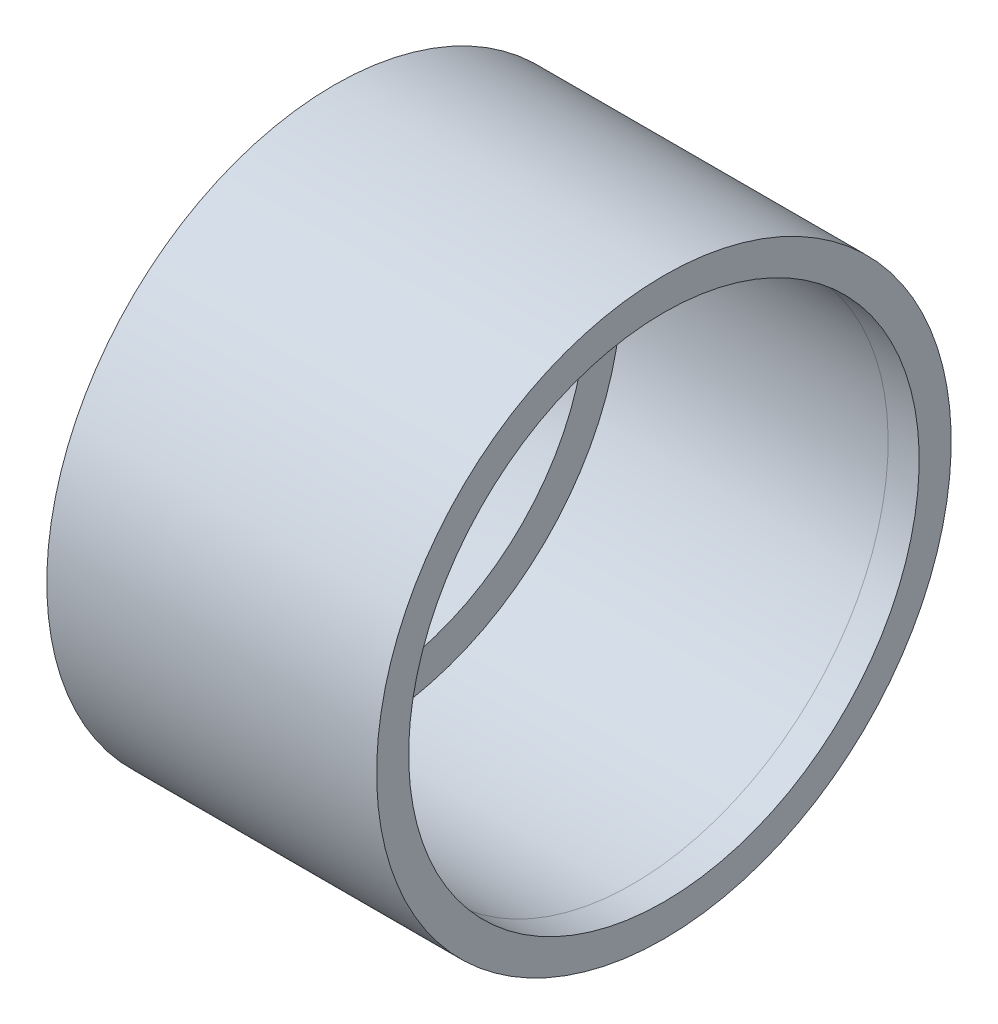
ISO-10303-21;
HEADER;
FILE_DESCRIPTION(('STEP AP214'),'2;1');
FILE_NAME('part.step','',(''),(''),'','','');
FILE_SCHEMA(('AUTOMOTIVE_DESIGN { 1 0 10303 214 1 1 1 1 }'));
ENDSEC;
DATA;
#1=APPLICATION_CONTEXT('core data for automotive mechanical design processes');
#2=APPLICATION_PROTOCOL_DEFINITION('international standard','automotive_design',2000,#1);
#3=PRODUCT_CONTEXT('',#1,'mechanical');
#4=PRODUCT('Part','Part','',(#3));
#5=PRODUCT_RELATED_PRODUCT_CATEGORY('part','',(#4));
#6=PRODUCT_DEFINITION_FORMATION('','',#4);
#7=PRODUCT_DEFINITION_CONTEXT('part definition',#1,'design');
#8=PRODUCT_DEFINITION('design','',#6,#7);
#9=PRODUCT_DEFINITION_SHAPE('','',#8);
#10=(LENGTH_UNIT() NAMED_UNIT(*) SI_UNIT(.MILLI.,.METRE.));
#11=(NAMED_UNIT(*) PLANE_ANGLE_UNIT() SI_UNIT($,.RADIAN.));
#12=(NAMED_UNIT(*) SI_UNIT($,.STERADIAN.) SOLID_ANGLE_UNIT());
#13=UNCERTAINTY_MEASURE_WITH_UNIT(LENGTH_MEASURE(1.E-05),#10,'distance_accuracy_value','');
#14=(GEOMETRIC_REPRESENTATION_CONTEXT(3) GLOBAL_UNCERTAINTY_ASSIGNED_CONTEXT((#13)) GLOBAL_UNIT_ASSIGNED_CONTEXT((#10,
#11,#12)) REPRESENTATION_CONTEXT('',''));
#15=CARTESIAN_POINT('',(0.,0.,0.));
#16=DIRECTION('',(0.,0.,1.));
#17=DIRECTION('',(1.,0.,0.));
#18=AXIS2_PLACEMENT_3D('',#15,#16,#17);
#19=CARTESIAN_POINT('',(-18.9164281281048,0.,0.));
#20=DIRECTION('',(1.,0.,0.));
#21=DIRECTION('',(0.,1.,0.));
#22=AXIS2_PLACEMENT_3D('',#19,#20,#21);
#23=PLANE('',#22);
#24=CARTESIAN_POINT('',(-18.9164281281048,0.,0.));
#25=DIRECTION('',(-1.,0.,0.));
#26=DIRECTION('',(0.,-1.,0.));
#27=AXIS2_PLACEMENT_3D('',#24,#25,#26);
#28=CIRCLE('',#27,13.4055538021859);
#29=CARTESIAN_POINT('',(-18.9164281281048,-13.4055538021859,0.));
#30=VERTEX_POINT('',#29);
#31=EDGE_CURVE('E53',#30,#30,#28,.T.);
#32=ORIENTED_EDGE('',*,*,#31,.F.);
#33=EDGE_LOOP('',(#32));
#34=FACE_BOUND('',#33,.T.);
#35=CARTESIAN_POINT('',(-18.9164281281048,0.,0.));
#36=DIRECTION('',(1.,0.,0.));
#37=DIRECTION('',(0.,1.,0.));
#38=AXIS2_PLACEMENT_3D('',#35,#36,#37);
#39=CIRCLE('',#38,18.2189897640092);
#40=CARTESIAN_POINT('',(-18.9164281281048,18.2189897640092,0.));
#41=VERTEX_POINT('',#40);
#42=EDGE_CURVE('E41',#41,#41,#39,.T.);
#43=ORIENTED_EDGE('',*,*,#42,.F.);
#44=EDGE_LOOP('',(#43));
#45=FACE_BOUND('',#44,.T.);
#46=ADVANCED_FACE('F31',(#34,#45),#23,.F.);
#47=CARTESIAN_POINT('',(2.,0.,0.));
#48=DIRECTION('',(-1.,0.,0.));
#49=DIRECTION('',(0.,-1.,0.));
#50=AXIS2_PLACEMENT_3D('',#47,#48,#49);
#51=PLANE('',#50);
#52=CARTESIAN_POINT('',(1.99999999999997,0.,0.));
#53=DIRECTION('',(-1.,0.,0.));
#54=DIRECTION('',(0.,-1.,0.));
#55=AXIS2_PLACEMENT_3D('',#52,#53,#54);
#56=CIRCLE('',#55,16.1882132471324);
#57=CARTESIAN_POINT('',(1.99999999999997,-16.1882132471324,0.));
#58=VERTEX_POINT('',#57);
#59=EDGE_CURVE('E56',#58,#58,#56,.T.);
#60=ORIENTED_EDGE('',*,*,#59,.T.);
#61=EDGE_LOOP('',(#60));
#62=FACE_BOUND('',#61,.T.);
#63=CARTESIAN_POINT('',(2.,0.,0.));
#64=DIRECTION('',(1.,0.,0.));
#65=DIRECTION('',(0.,1.,0.));
#66=AXIS2_PLACEMENT_3D('',#63,#64,#65);
#67=CIRCLE('',#66,18.2189897640092);
#68=CARTESIAN_POINT('',(2.,18.2189897640092,0.));
#69=VERTEX_POINT('',#68);
#70=EDGE_CURVE('E37',#69,#69,#67,.T.);
#71=ORIENTED_EDGE('',*,*,#70,.T.);
#72=EDGE_LOOP('',(#71));
#73=FACE_BOUND('',#72,.T.);
#74=ADVANCED_FACE('F60',(#62,#73),#51,.F.);
#75=CARTESIAN_POINT('',(-16.9164281281048,0.,0.));
#76=DIRECTION('',(1.,0.,0.));
#77=DIRECTION('',(0.,1.,0.));
#78=AXIS2_PLACEMENT_3D('',#75,#76,#77);
#79=CYLINDRICAL_SURFACE('',#78,18.2189897640092);
#80=ORIENTED_EDGE('',*,*,#70,.F.);
#81=EDGE_LOOP('',(#80));
#82=FACE_BOUND('',#81,.T.);
#83=ORIENTED_EDGE('',*,*,#42,.T.);
#84=EDGE_LOOP('',(#83));
#85=FACE_BOUND('',#84,.T.);
#86=ADVANCED_FACE('F66',(#82,#85),#79,.T.);
#87=CARTESIAN_POINT('',(0.,0.,0.));
#88=DIRECTION('',(-1.,0.,0.));
#89=DIRECTION('',(0.,-1.,0.));
#90=AXIS2_PLACEMENT_3D('',#87,#88,#89);
#91=DEGENERATE_TOROIDAL_SURFACE('',#90,48.7810102359908,65.,.F.);
#92=ORIENTED_EDGE('',*,*,#59,.F.);
#93=EDGE_LOOP('',(#92));
#94=FACE_BOUND('',#93,.T.);
#95=CARTESIAN_POINT('',(0.,0.,0.));
#96=DIRECTION('',(1.,0.,0.));
#97=DIRECTION('',(0.,1.,0.));
#98=AXIS2_PLACEMENT_3D('',#95,#96,#97);
#99=CIRCLE('',#98,16.2189897640092);
#100=CARTESIAN_POINT('',(0.,16.2189897640092,0.));
#101=VERTEX_POINT('',#100);
#102=EDGE_CURVE('E50',#101,#101,#99,.T.);
#103=ORIENTED_EDGE('',*,*,#102,.F.);
#104=EDGE_LOOP('',(#103));
#105=FACE_BOUND('',#104,.T.);
#106=ADVANCED_FACE('F62',(#94,#105),#91,.T.);
#107=ORIENTED_EDGE('',*,*,#31,.T.);
#108=EDGE_LOOP('',(#107));
#109=FACE_BOUND('',#108,.T.);
#110=CARTESIAN_POINT('',(-16.9164281281048,0.,0.));
#111=DIRECTION('',(-1.,0.,0.));
#112=DIRECTION('',(0.,-1.,0.));
#113=AXIS2_PLACEMENT_3D('',#110,#111,#112);
#114=CIRCLE('',#113,13.9791240802029);
#115=CARTESIAN_POINT('',(-16.9164281281048,-13.9791240802029,0.));
#116=VERTEX_POINT('',#115);
#117=EDGE_CURVE('E45',#116,#116,#114,.T.);
#118=ORIENTED_EDGE('',*,*,#117,.F.);
#119=EDGE_LOOP('',(#118));
#120=FACE_BOUND('',#119,.T.);
#121=ADVANCED_FACE('F65',(#109,#120),#91,.T.);
#122=CARTESIAN_POINT('',(-16.9164281281048,0.,0.));
#123=DIRECTION('',(-1.,0.,0.));
#124=DIRECTION('',(0.,-1.,0.));
#125=AXIS2_PLACEMENT_3D('',#122,#123,#124);
#126=PLANE('',#125);
#127=ORIENTED_EDGE('',*,*,#117,.T.);
#128=EDGE_LOOP('',(#127));
#129=FACE_BOUND('',#128,.T.);
#130=CARTESIAN_POINT('',(-16.9164281281048,0.,0.));
#131=DIRECTION('',(1.,0.,0.));
#132=DIRECTION('',(0.,1.,0.));
#133=AXIS2_PLACEMENT_3D('',#130,#131,#132);
#134=CIRCLE('',#133,16.2189897640092);
#135=CARTESIAN_POINT('',(-16.9164281281048,16.2189897640092,0.));
#136=VERTEX_POINT('',#135);
#137=EDGE_CURVE('E10',#136,#136,#134,.T.);
#138=ORIENTED_EDGE('',*,*,#137,.T.);
#139=EDGE_LOOP('',(#138));
#140=FACE_BOUND('',#139,.T.);
#141=ADVANCED_FACE('F72',(#129,#140),#126,.F.);
#142=CARTESIAN_POINT('',(-16.9164281281048,0.,0.));
#143=DIRECTION('',(1.,0.,0.));
#144=DIRECTION('',(0.,1.,0.));
#145=AXIS2_PLACEMENT_3D('',#142,#143,#144);
#146=CYLINDRICAL_SURFACE('',#145,16.2189897640092);
#147=ORIENTED_EDGE('',*,*,#137,.F.);
#148=EDGE_LOOP('',(#147));
#149=FACE_BOUND('',#148,.T.);
#150=ORIENTED_EDGE('',*,*,#102,.T.);
#151=EDGE_LOOP('',(#150));
#152=FACE_BOUND('',#151,.T.);
#153=ADVANCED_FACE('F70',(#149,#152),#146,.F.);
#154=CLOSED_SHELL('',(#46,#74,#86,#106,#121,#141,#153));
#155=MANIFOLD_SOLID_BREP('B2',#154);
#156=ADVANCED_BREP_SHAPE_REPRESENTATION('',(#18,#155),#14);
#157=SHAPE_DEFINITION_REPRESENTATION(#9,#156);
ENDSEC;
END-ISO-10303-21;
